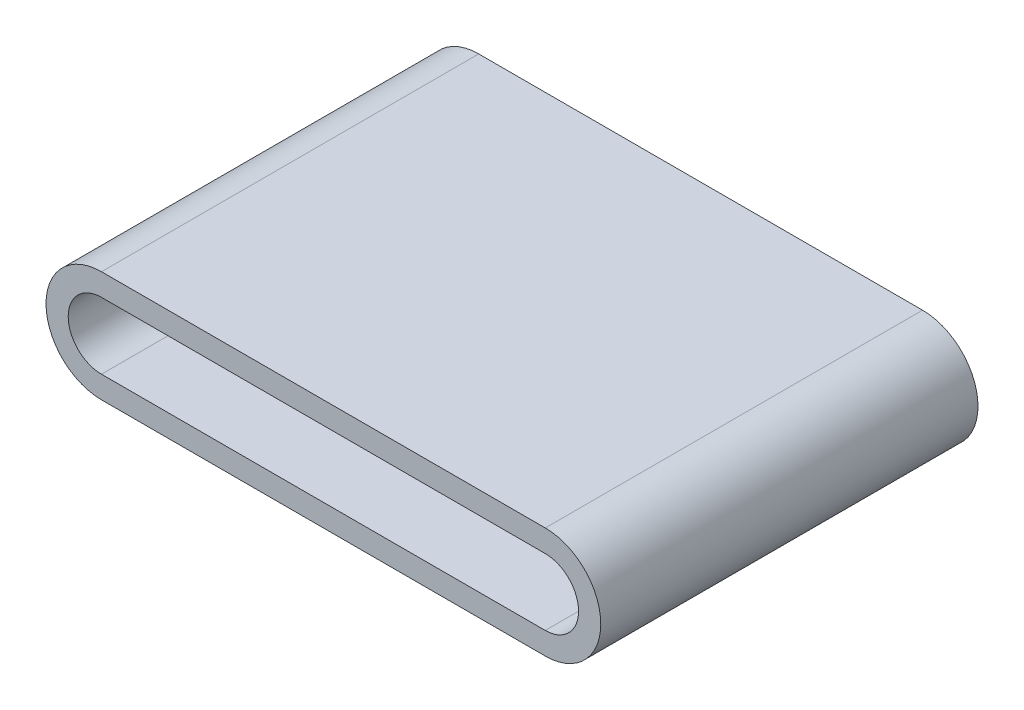
ISO-10303-21;
HEADER;
FILE_DESCRIPTION(('STEP AP214'),'2;1');
FILE_NAME('part.step','',(''),(''),'','','');
FILE_SCHEMA(('AUTOMOTIVE_DESIGN { 1 0 10303 214 1 1 1 1 }'));
ENDSEC;
DATA;
#1=APPLICATION_CONTEXT('core data for automotive mechanical design processes');
#2=APPLICATION_PROTOCOL_DEFINITION('international standard','automotive_design',2000,#1);
#3=PRODUCT_CONTEXT('',#1,'mechanical');
#4=PRODUCT('Part','Part','',(#3));
#5=PRODUCT_RELATED_PRODUCT_CATEGORY('part','',(#4));
#6=PRODUCT_DEFINITION_FORMATION('','',#4);
#7=PRODUCT_DEFINITION_CONTEXT('part definition',#1,'design');
#8=PRODUCT_DEFINITION('design','',#6,#7);
#9=PRODUCT_DEFINITION_SHAPE('','',#8);
#10=(LENGTH_UNIT() NAMED_UNIT(*) SI_UNIT(.MILLI.,.METRE.));
#11=(NAMED_UNIT(*) PLANE_ANGLE_UNIT() SI_UNIT($,.RADIAN.));
#12=(NAMED_UNIT(*) SI_UNIT($,.STERADIAN.) SOLID_ANGLE_UNIT());
#13=UNCERTAINTY_MEASURE_WITH_UNIT(LENGTH_MEASURE(1.E-05),#10,'distance_accuracy_value','');
#14=(GEOMETRIC_REPRESENTATION_CONTEXT(3) GLOBAL_UNCERTAINTY_ASSIGNED_CONTEXT((#13)) GLOBAL_UNIT_ASSIGNED_CONTEXT((#10,
#11,#12)) REPRESENTATION_CONTEXT('',''));
#15=CARTESIAN_POINT('',(0.,0.,0.));
#16=DIRECTION('',(0.,0.,1.));
#17=DIRECTION('',(1.,0.,0.));
#18=AXIS2_PLACEMENT_3D('',#15,#16,#17);
#19=CARTESIAN_POINT('',(0.,0.,-10.));
#20=DIRECTION('',(0.,0.,1.));
#21=DIRECTION('',(1.,0.,0.));
#22=AXIS2_PLACEMENT_3D('',#19,#20,#21);
#23=CYLINDRICAL_SURFACE('',#22,12.5);
#24=DIRECTION('',(0.,0.,1.));
#25=VECTOR('',#24,1.);
#26=CARTESIAN_POINT('',(0.,-12.5,-10.));
#27=LINE('',#26,#25);
#28=CARTESIAN_POINT('',(0.,-12.5,-10.));
#29=VERTEX_POINT('',#28);
#30=CARTESIAN_POINT('',(0.,-12.5,75.));
#31=VERTEX_POINT('',#30);
#32=EDGE_CURVE('E63',#29,#31,#27,.T.);
#33=ORIENTED_EDGE('',*,*,#32,.T.);
#34=CARTESIAN_POINT('',(0.,0.,75.));
#35=DIRECTION('',(0.,0.,1.));
#36=DIRECTION('',(1.,0.,0.));
#37=AXIS2_PLACEMENT_3D('',#34,#35,#36);
#38=CIRCLE('',#37,12.5);
#39=CARTESIAN_POINT('',(0.,12.5,75.));
#40=VERTEX_POINT('',#39);
#41=EDGE_CURVE('E139',#40,#31,#38,.T.);
#42=ORIENTED_EDGE('',*,*,#41,.F.);
#43=DIRECTION('',(0.,0.,1.));
#44=VECTOR('',#43,1.);
#45=CARTESIAN_POINT('',(0.,12.5,-10.));
#46=LINE('',#45,#44);
#47=CARTESIAN_POINT('',(0.,12.5,-10.));
#48=VERTEX_POINT('',#47);
#49=EDGE_CURVE('E12',#48,#40,#46,.T.);
#50=ORIENTED_EDGE('',*,*,#49,.F.);
#51=CARTESIAN_POINT('',(0.,0.,-10.));
#52=DIRECTION('',(0.,0.,1.));
#53=DIRECTION('',(1.,0.,0.));
#54=AXIS2_PLACEMENT_3D('',#51,#52,#53);
#55=CIRCLE('',#54,12.5);
#56=EDGE_CURVE('E172',#48,#29,#55,.T.);
#57=ORIENTED_EDGE('',*,*,#56,.T.);
#58=EDGE_LOOP('',(#33,#42,#50,#57));
#59=FACE_BOUND('',#58,.T.);
#60=ADVANCED_FACE('F60',(#59),#23,.T.);
#61=CARTESIAN_POINT('',(0.,12.5,-10.));
#62=DIRECTION('',(0.,1.,0.));
#63=DIRECTION('',(-1.,0.,0.));
#64=AXIS2_PLACEMENT_3D('',#61,#62,#63);
#65=PLANE('',#64);
#66=ORIENTED_EDGE('',*,*,#49,.T.);
#67=DIRECTION('',(-1.,0.,0.));
#68=VECTOR('',#67,1.);
#69=CARTESIAN_POINT('',(100.,12.5,75.));
#70=LINE('',#69,#68);
#71=CARTESIAN_POINT('',(100.,12.5,75.));
#72=VERTEX_POINT('',#71);
#73=EDGE_CURVE('E169',#72,#40,#70,.T.);
#74=ORIENTED_EDGE('',*,*,#73,.F.);
#75=DIRECTION('',(0.,0.,1.));
#76=VECTOR('',#75,1.);
#77=CARTESIAN_POINT('',(100.,12.5,-10.));
#78=LINE('',#77,#76);
#79=CARTESIAN_POINT('',(100.,12.5,-10.));
#80=VERTEX_POINT('',#79);
#81=EDGE_CURVE('E68',#80,#72,#78,.T.);
#82=ORIENTED_EDGE('',*,*,#81,.F.);
#83=DIRECTION('',(-1.,0.,0.));
#84=VECTOR('',#83,1.);
#85=CARTESIAN_POINT('',(0.,12.5,-10.));
#86=LINE('',#85,#84);
#87=EDGE_CURVE('E181',#80,#48,#86,.T.);
#88=ORIENTED_EDGE('',*,*,#87,.T.);
#89=EDGE_LOOP('',(#66,#74,#82,#88));
#90=FACE_BOUND('',#89,.T.);
#91=ADVANCED_FACE('F196',(#90),#65,.T.);
#92=CARTESIAN_POINT('',(100.,0.,-10.));
#93=DIRECTION('',(0.,0.,1.));
#94=DIRECTION('',(1.,0.,0.));
#95=AXIS2_PLACEMENT_3D('',#92,#93,#94);
#96=CYLINDRICAL_SURFACE('',#95,12.5);
#97=ORIENTED_EDGE('',*,*,#81,.T.);
#98=CARTESIAN_POINT('',(100.,0.,75.));
#99=DIRECTION('',(0.,0.,1.));
#100=DIRECTION('',(1.,0.,0.));
#101=AXIS2_PLACEMENT_3D('',#98,#99,#100);
#102=CIRCLE('',#101,12.5);
#103=CARTESIAN_POINT('',(100.,-12.5,75.));
#104=VERTEX_POINT('',#103);
#105=EDGE_CURVE('E166',#104,#72,#102,.T.);
#106=ORIENTED_EDGE('',*,*,#105,.F.);
#107=DIRECTION('',(0.,0.,1.));
#108=VECTOR('',#107,1.);
#109=CARTESIAN_POINT('',(100.,-12.5,-10.));
#110=LINE('',#109,#108);
#111=CARTESIAN_POINT('',(100.,-12.5,-10.));
#112=VERTEX_POINT('',#111);
#113=EDGE_CURVE('E184',#112,#104,#110,.T.);
#114=ORIENTED_EDGE('',*,*,#113,.F.);
#115=CARTESIAN_POINT('',(100.,0.,-10.));
#116=DIRECTION('',(0.,0.,1.));
#117=DIRECTION('',(1.,0.,0.));
#118=AXIS2_PLACEMENT_3D('',#115,#116,#117);
#119=CIRCLE('',#118,12.5);
#120=EDGE_CURVE('E178',#112,#80,#119,.T.);
#121=ORIENTED_EDGE('',*,*,#120,.T.);
#122=EDGE_LOOP('',(#97,#106,#114,#121));
#123=FACE_BOUND('',#122,.T.);
#124=ADVANCED_FACE('F202',(#123),#96,.T.);
#125=CARTESIAN_POINT('',(0.,-12.5,-10.));
#126=DIRECTION('',(0.,-1.,0.));
#127=DIRECTION('',(1.,0.,0.));
#128=AXIS2_PLACEMENT_3D('',#125,#126,#127);
#129=PLANE('',#128);
#130=ORIENTED_EDGE('',*,*,#113,.T.);
#131=DIRECTION('',(1.,0.,0.));
#132=VECTOR('',#131,1.);
#133=CARTESIAN_POINT('',(0.,-12.5,75.));
#134=LINE('',#133,#132);
#135=EDGE_CURVE('E163',#31,#104,#134,.T.);
#136=ORIENTED_EDGE('',*,*,#135,.F.);
#137=ORIENTED_EDGE('',*,*,#32,.F.);
#138=DIRECTION('',(1.,0.,0.));
#139=VECTOR('',#138,1.);
#140=CARTESIAN_POINT('',(0.,-12.5,-10.));
#141=LINE('',#140,#139);
#142=EDGE_CURVE('E175',#29,#112,#141,.T.);
#143=ORIENTED_EDGE('',*,*,#142,.T.);
#144=EDGE_LOOP('',(#130,#136,#137,#143));
#145=FACE_BOUND('',#144,.T.);
#146=ADVANCED_FACE('F191',(#145),#129,.T.);
#147=CARTESIAN_POINT('',(0.,0.,-10.));
#148=DIRECTION('',(0.,0.,1.));
#149=DIRECTION('',(1.,0.,0.));
#150=AXIS2_PLACEMENT_3D('',#147,#148,#149);
#151=PLANE('',#150);
#152=ORIENTED_EDGE('',*,*,#56,.F.);
#153=ORIENTED_EDGE('',*,*,#87,.F.);
#154=ORIENTED_EDGE('',*,*,#120,.F.);
#155=ORIENTED_EDGE('',*,*,#142,.F.);
#156=EDGE_LOOP('',(#152,#153,#154,#155));
#157=FACE_BOUND('',#156,.T.);
#158=ADVANCED_FACE('F199',(#157),#151,.F.);
#159=CARTESIAN_POINT('',(0.,0.,75.));
#160=DIRECTION('',(0.,0.,1.));
#161=DIRECTION('',(1.,0.,0.));
#162=AXIS2_PLACEMENT_3D('',#159,#160,#161);
#163=PLANE('',#162);
#164=ORIENTED_EDGE('',*,*,#41,.T.);
#165=ORIENTED_EDGE('',*,*,#135,.T.);
#166=ORIENTED_EDGE('',*,*,#105,.T.);
#167=ORIENTED_EDGE('',*,*,#73,.T.);
#168=EDGE_LOOP('',(#164,#165,#166,#167));
#169=FACE_BOUND('',#168,.T.);
#170=DIRECTION('',(1.,0.,0.));
#171=VECTOR('',#170,1.);
#172=CARTESIAN_POINT('',(0.,-7.5,75.));
#173=LINE('',#172,#171);
#174=CARTESIAN_POINT('',(0.,-7.5,75.));
#175=VERTEX_POINT('',#174);
#176=CARTESIAN_POINT('',(100.,-7.5,75.));
#177=VERTEX_POINT('',#176);
#178=EDGE_CURVE('E133',#175,#177,#173,.T.);
#179=ORIENTED_EDGE('',*,*,#178,.F.);
#180=CARTESIAN_POINT('',(0.,0.,75.));
#181=DIRECTION('',(0.,0.,1.));
#182=DIRECTION('',(1.,0.,0.));
#183=AXIS2_PLACEMENT_3D('',#180,#181,#182);
#184=CIRCLE('',#183,7.5);
#185=CARTESIAN_POINT('',(0.,7.5,75.));
#186=VERTEX_POINT('',#185);
#187=EDGE_CURVE('E124',#186,#175,#184,.T.);
#188=ORIENTED_EDGE('',*,*,#187,.F.);
#189=DIRECTION('',(-1.,0.,0.));
#190=VECTOR('',#189,1.);
#191=CARTESIAN_POINT('',(100.,7.5,75.));
#192=LINE('',#191,#190);
#193=CARTESIAN_POINT('',(100.,7.5,75.));
#194=VERTEX_POINT('',#193);
#195=EDGE_CURVE('E147',#194,#186,#192,.T.);
#196=ORIENTED_EDGE('',*,*,#195,.F.);
#197=CARTESIAN_POINT('',(100.,0.,75.));
#198=DIRECTION('',(0.,0.,1.));
#199=DIRECTION('',(1.,0.,0.));
#200=AXIS2_PLACEMENT_3D('',#197,#198,#199);
#201=CIRCLE('',#200,7.5);
#202=EDGE_CURVE('E145',#177,#194,#201,.T.);
#203=ORIENTED_EDGE('',*,*,#202,.F.);
#204=EDGE_LOOP('',(#179,#188,#196,#203));
#205=FACE_BOUND('',#204,.T.);
#206=ADVANCED_FACE('F143',(#169,#205),#163,.T.);
#207=CARTESIAN_POINT('',(0.,0.,75.));
#208=DIRECTION('',(0.,0.,-1.));
#209=DIRECTION('',(-1.,0.,0.));
#210=AXIS2_PLACEMENT_3D('',#207,#208,#209);
#211=CYLINDRICAL_SURFACE('',#210,7.5);
#212=CARTESIAN_POINT('',(0.,0.,20.));
#213=DIRECTION('',(0.,0.,1.));
#214=DIRECTION('',(1.,0.,0.));
#215=AXIS2_PLACEMENT_3D('',#212,#213,#214);
#216=CIRCLE('',#215,7.5);
#217=CARTESIAN_POINT('',(0.,7.5,20.));
#218=VERTEX_POINT('',#217);
#219=CARTESIAN_POINT('',(0.,-7.5,20.));
#220=VERTEX_POINT('',#219);
#221=EDGE_CURVE('E76',#218,#220,#216,.T.);
#222=ORIENTED_EDGE('',*,*,#221,.F.);
#223=DIRECTION('',(0.,0.,-1.));
#224=VECTOR('',#223,1.);
#225=CARTESIAN_POINT('',(0.,7.5,75.));
#226=LINE('',#225,#224);
#227=EDGE_CURVE('E129',#186,#218,#226,.T.);
#228=ORIENTED_EDGE('',*,*,#227,.F.);
#229=ORIENTED_EDGE('',*,*,#187,.T.);
#230=DIRECTION('',(0.,0.,-1.));
#231=VECTOR('',#230,1.);
#232=CARTESIAN_POINT('',(0.,-7.5,75.));
#233=LINE('',#232,#231);
#234=EDGE_CURVE('E127',#175,#220,#233,.T.);
#235=ORIENTED_EDGE('',*,*,#234,.T.);
#236=EDGE_LOOP('',(#222,#228,#229,#235));
#237=FACE_BOUND('',#236,.T.);
#238=ADVANCED_FACE('F126',(#237),#211,.F.);
#239=CARTESIAN_POINT('',(0.,-7.5,75.));
#240=DIRECTION('',(0.,1.,0.));
#241=DIRECTION('',(-1.,0.,0.));
#242=AXIS2_PLACEMENT_3D('',#239,#240,#241);
#243=PLANE('',#242);
#244=DIRECTION('',(1.,0.,0.));
#245=VECTOR('',#244,1.);
#246=CARTESIAN_POINT('',(0.,-7.5,20.));
#247=LINE('',#246,#245);
#248=CARTESIAN_POINT('',(100.,-7.5,20.));
#249=VERTEX_POINT('',#248);
#250=EDGE_CURVE('E80',#220,#249,#247,.T.);
#251=ORIENTED_EDGE('',*,*,#250,.F.);
#252=ORIENTED_EDGE('',*,*,#234,.F.);
#253=ORIENTED_EDGE('',*,*,#178,.T.);
#254=DIRECTION('',(0.,0.,-1.));
#255=VECTOR('',#254,1.);
#256=CARTESIAN_POINT('',(100.,-7.5,75.));
#257=LINE('',#256,#255);
#258=EDGE_CURVE('E140',#177,#249,#257,.T.);
#259=ORIENTED_EDGE('',*,*,#258,.T.);
#260=EDGE_LOOP('',(#251,#252,#253,#259));
#261=FACE_BOUND('',#260,.T.);
#262=ADVANCED_FACE('F137',(#261),#243,.T.);
#263=CARTESIAN_POINT('',(100.,0.,75.));
#264=DIRECTION('',(0.,0.,-1.));
#265=DIRECTION('',(-1.,0.,0.));
#266=AXIS2_PLACEMENT_3D('',#263,#264,#265);
#267=CYLINDRICAL_SURFACE('',#266,7.5);
#268=CARTESIAN_POINT('',(100.,0.,20.));
#269=DIRECTION('',(0.,0.,1.));
#270=DIRECTION('',(1.,0.,0.));
#271=AXIS2_PLACEMENT_3D('',#268,#269,#270);
#272=CIRCLE('',#271,7.5);
#273=CARTESIAN_POINT('',(100.,7.5,20.));
#274=VERTEX_POINT('',#273);
#275=EDGE_CURVE('E153',#249,#274,#272,.T.);
#276=ORIENTED_EDGE('',*,*,#275,.F.);
#277=ORIENTED_EDGE('',*,*,#258,.F.);
#278=ORIENTED_EDGE('',*,*,#202,.T.);
#279=DIRECTION('',(0.,0.,-1.));
#280=VECTOR('',#279,1.);
#281=CARTESIAN_POINT('',(100.,7.5,75.));
#282=LINE('',#281,#280);
#283=EDGE_CURVE('E157',#194,#274,#282,.T.);
#284=ORIENTED_EDGE('',*,*,#283,.T.);
#285=EDGE_LOOP('',(#276,#277,#278,#284));
#286=FACE_BOUND('',#285,.T.);
#287=ADVANCED_FACE('F257',(#286),#267,.F.);
#288=CARTESIAN_POINT('',(100.,7.5,75.));
#289=DIRECTION('',(0.,-1.,0.));
#290=DIRECTION('',(1.,0.,0.));
#291=AXIS2_PLACEMENT_3D('',#288,#289,#290);
#292=PLANE('',#291);
#293=DIRECTION('',(-1.,0.,0.));
#294=VECTOR('',#293,1.);
#295=CARTESIAN_POINT('',(100.,7.5,20.));
#296=LINE('',#295,#294);
#297=EDGE_CURVE('E134',#274,#218,#296,.T.);
#298=ORIENTED_EDGE('',*,*,#297,.F.);
#299=ORIENTED_EDGE('',*,*,#283,.F.);
#300=ORIENTED_EDGE('',*,*,#195,.T.);
#301=ORIENTED_EDGE('',*,*,#227,.T.);
#302=EDGE_LOOP('',(#298,#299,#300,#301));
#303=FACE_BOUND('',#302,.T.);
#304=ADVANCED_FACE('F266',(#303),#292,.T.);
#305=CARTESIAN_POINT('',(0.,0.,20.));
#306=DIRECTION('',(0.,0.,1.));
#307=DIRECTION('',(1.,0.,0.));
#308=AXIS2_PLACEMENT_3D('',#305,#306,#307);
#309=PLANE('',#308);
#310=ORIENTED_EDGE('',*,*,#221,.T.);
#311=ORIENTED_EDGE('',*,*,#250,.T.);
#312=ORIENTED_EDGE('',*,*,#275,.T.);
#313=ORIENTED_EDGE('',*,*,#297,.T.);
#314=EDGE_LOOP('',(#310,#311,#312,#313));
#315=FACE_BOUND('',#314,.T.);
#316=ADVANCED_FACE('F276',(#315),#309,.T.);
#317=CLOSED_SHELL('',(#60,#91,#124,#146,#158,#206,#238,#262,#287,#304,#316));
#318=MANIFOLD_SOLID_BREP('B2',#317);
#319=ADVANCED_BREP_SHAPE_REPRESENTATION('',(#18,#318),#14);
#320=SHAPE_DEFINITION_REPRESENTATION(#9,#319);
ENDSEC;
END-ISO-10303-21;
